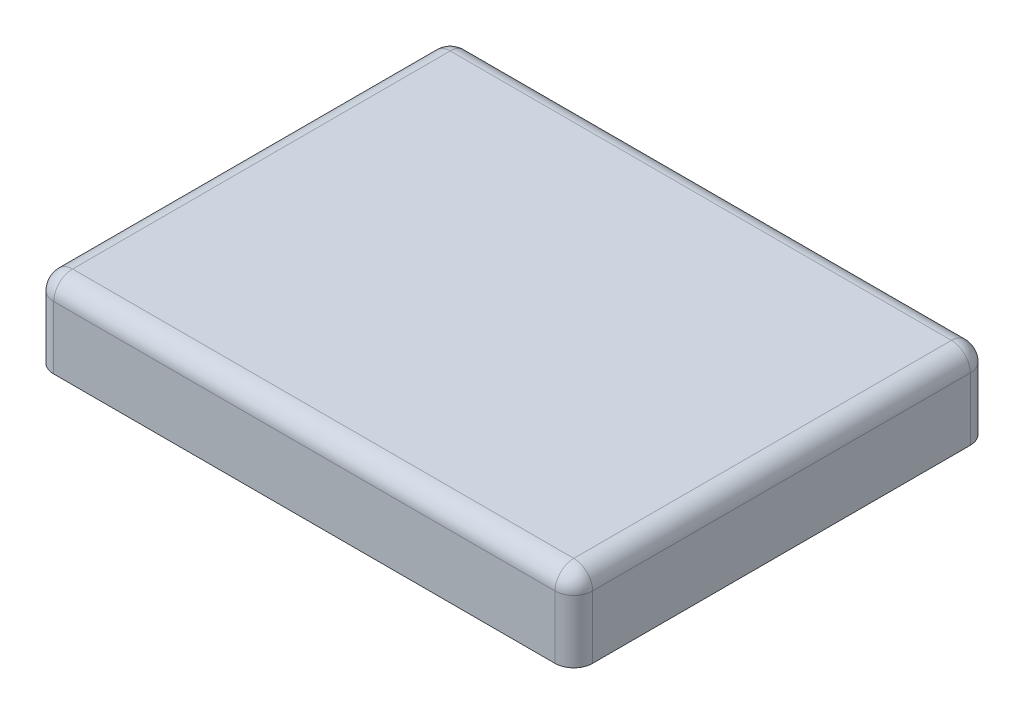
ISO-10303-21;
HEADER;
FILE_DESCRIPTION(('STEP AP214'),'2;1');
FILE_NAME('part.step','',(''),(''),'','','');
FILE_SCHEMA(('AUTOMOTIVE_DESIGN { 1 0 10303 214 1 1 1 1 }'));
ENDSEC;
DATA;
#1=APPLICATION_CONTEXT('core data for automotive mechanical design processes');
#2=APPLICATION_PROTOCOL_DEFINITION('international standard','automotive_design',2000,#1);
#3=PRODUCT_CONTEXT('',#1,'mechanical');
#4=PRODUCT('Part','Part','',(#3));
#5=PRODUCT_RELATED_PRODUCT_CATEGORY('part','',(#4));
#6=PRODUCT_DEFINITION_FORMATION('','',#4);
#7=PRODUCT_DEFINITION_CONTEXT('part definition',#1,'design');
#8=PRODUCT_DEFINITION('design','',#6,#7);
#9=PRODUCT_DEFINITION_SHAPE('','',#8);
#10=(LENGTH_UNIT() NAMED_UNIT(*) SI_UNIT(.MILLI.,.METRE.));
#11=(NAMED_UNIT(*) PLANE_ANGLE_UNIT() SI_UNIT($,.RADIAN.));
#12=(NAMED_UNIT(*) SI_UNIT($,.STERADIAN.) SOLID_ANGLE_UNIT());
#13=UNCERTAINTY_MEASURE_WITH_UNIT(LENGTH_MEASURE(1.E-05),#10,'distance_accuracy_value','');
#14=(GEOMETRIC_REPRESENTATION_CONTEXT(3) GLOBAL_UNCERTAINTY_ASSIGNED_CONTEXT((#13)) GLOBAL_UNIT_ASSIGNED_CONTEXT((#10,
#11,#12)) REPRESENTATION_CONTEXT('',''));
#15=CARTESIAN_POINT('',(0.,0.,0.));
#16=DIRECTION('',(0.,0.,1.));
#17=DIRECTION('',(1.,0.,0.));
#18=AXIS2_PLACEMENT_3D('',#15,#16,#17);
#19=CARTESIAN_POINT('',(0.,66.04,0.));
#20=DIRECTION('',(1.,0.,0.));
#21=DIRECTION('',(0.,0.,-1.));
#22=AXIS2_PLACEMENT_3D('',#19,#20,#21);
#23=PLANE('',#22);
#24=DIRECTION('',(0.,0.,1.));
#25=VECTOR('',#24,1.);
#26=CARTESIAN_POINT('',(0.,50.8,0.));
#27=LINE('',#26,#25);
#28=CARTESIAN_POINT('',(0.,50.8,-15.24));
#29=VERTEX_POINT('',#28);
#30=CARTESIAN_POINT('',(0.,50.8,-321.056));
#31=VERTEX_POINT('',#30);
#32=EDGE_CURVE('E128',#29,#31,#27,.F.);
#33=ORIENTED_EDGE('',*,*,#32,.T.);
#34=DIRECTION('',(0.,-1.,0.));
#35=VECTOR('',#34,1.);
#36=CARTESIAN_POINT('',(0.,66.04,-321.056));
#37=LINE('',#36,#35);
#38=CARTESIAN_POINT('',(0.,0.,-321.056));
#39=VERTEX_POINT('',#38);
#40=EDGE_CURVE('E114',#31,#39,#37,.T.);
#41=ORIENTED_EDGE('',*,*,#40,.T.);
#42=DIRECTION('',(0.,0.,1.));
#43=VECTOR('',#42,1.);
#44=CARTESIAN_POINT('',(0.,0.,0.));
#45=LINE('',#44,#43);
#46=CARTESIAN_POINT('',(0.,0.,-15.24));
#47=VERTEX_POINT('',#46);
#48=EDGE_CURVE('E125',#39,#47,#45,.T.);
#49=ORIENTED_EDGE('',*,*,#48,.T.);
#50=DIRECTION('',(0.,-1.,0.));
#51=VECTOR('',#50,1.);
#52=CARTESIAN_POINT('',(0.,66.04,-15.24));
#53=LINE('',#52,#51);
#54=EDGE_CURVE('E131',#47,#29,#53,.F.);
#55=ORIENTED_EDGE('',*,*,#54,.T.);
#56=EDGE_LOOP('',(#33,#41,#49,#55));
#57=FACE_BOUND('',#56,.T.);
#58=ADVANCED_FACE('F33',(#57),#23,.F.);
#59=CARTESIAN_POINT('',(0.,66.04,0.));
#60=DIRECTION('',(0.,0.,-1.));
#61=DIRECTION('',(-1.,0.,0.));
#62=AXIS2_PLACEMENT_3D('',#59,#60,#61);
#63=PLANE('',#62);
#64=DIRECTION('',(1.,0.,0.));
#65=VECTOR('',#64,1.);
#66=CARTESIAN_POINT('',(0.,0.,0.));
#67=LINE('',#66,#65);
#68=CARTESIAN_POINT('',(15.24,0.,0.));
#69=VERTEX_POINT('',#68);
#70=CARTESIAN_POINT('',(421.132,0.,0.));
#71=VERTEX_POINT('',#70);
#72=EDGE_CURVE('E136',#69,#71,#67,.T.);
#73=ORIENTED_EDGE('',*,*,#72,.T.);
#74=DIRECTION('',(0.,-1.,0.));
#75=VECTOR('',#74,1.);
#76=CARTESIAN_POINT('',(421.132,66.04,0.));
#77=LINE('',#76,#75);
#78=CARTESIAN_POINT('',(421.132,50.8,0.));
#79=VERTEX_POINT('',#78);
#80=EDGE_CURVE('E11',#71,#79,#77,.F.);
#81=ORIENTED_EDGE('',*,*,#80,.T.);
#82=DIRECTION('',(1.,0.,0.));
#83=VECTOR('',#82,1.);
#84=CARTESIAN_POINT('',(0.,50.8,0.));
#85=LINE('',#84,#83);
#86=CARTESIAN_POINT('',(15.24,50.8,0.));
#87=VERTEX_POINT('',#86);
#88=EDGE_CURVE('E49',#79,#87,#85,.F.);
#89=ORIENTED_EDGE('',*,*,#88,.T.);
#90=DIRECTION('',(0.,-1.,0.));
#91=VECTOR('',#90,1.);
#92=CARTESIAN_POINT('',(15.24,66.04,0.));
#93=LINE('',#92,#91);
#94=EDGE_CURVE('E42',#87,#69,#93,.T.);
#95=ORIENTED_EDGE('',*,*,#94,.T.);
#96=EDGE_LOOP('',(#73,#81,#89,#95));
#97=FACE_BOUND('',#96,.T.);
#98=ADVANCED_FACE('F244',(#97),#63,.F.);
#99=CARTESIAN_POINT('',(436.372,66.04,0.));
#100=DIRECTION('',(-1.,0.,0.));
#101=DIRECTION('',(0.,0.,1.));
#102=AXIS2_PLACEMENT_3D('',#99,#100,#101);
#103=PLANE('',#102);
#104=DIRECTION('',(0.,0.,-1.));
#105=VECTOR('',#104,1.);
#106=CARTESIAN_POINT('',(436.372,0.,0.));
#107=LINE('',#106,#105);
#108=CARTESIAN_POINT('',(436.372,0.,-15.24));
#109=VERTEX_POINT('',#108);
#110=CARTESIAN_POINT('',(436.372,0.,-321.056));
#111=VERTEX_POINT('',#110);
#112=EDGE_CURVE('E138',#109,#111,#107,.T.);
#113=ORIENTED_EDGE('',*,*,#112,.T.);
#114=DIRECTION('',(0.,-1.,0.));
#115=VECTOR('',#114,1.);
#116=CARTESIAN_POINT('',(436.372,66.04,-321.056));
#117=LINE('',#116,#115);
#118=CARTESIAN_POINT('',(436.372,50.8,-321.056));
#119=VERTEX_POINT('',#118);
#120=EDGE_CURVE('E170',#111,#119,#117,.F.);
#121=ORIENTED_EDGE('',*,*,#120,.T.);
#122=DIRECTION('',(0.,0.,-1.));
#123=VECTOR('',#122,1.);
#124=CARTESIAN_POINT('',(436.372,50.8,0.));
#125=LINE('',#124,#123);
#126=CARTESIAN_POINT('',(436.372,50.8,-15.24));
#127=VERTEX_POINT('',#126);
#128=EDGE_CURVE('E168',#119,#127,#125,.F.);
#129=ORIENTED_EDGE('',*,*,#128,.T.);
#130=DIRECTION('',(0.,-1.,0.));
#131=VECTOR('',#130,1.);
#132=CARTESIAN_POINT('',(436.372,66.04,-15.24));
#133=LINE('',#132,#131);
#134=EDGE_CURVE('E166',#127,#109,#133,.T.);
#135=ORIENTED_EDGE('',*,*,#134,.T.);
#136=EDGE_LOOP('',(#113,#121,#129,#135));
#137=FACE_BOUND('',#136,.T.);
#138=ADVANCED_FACE('F217',(#137),#103,.F.);
#139=CARTESIAN_POINT('',(0.,66.04,-336.296));
#140=DIRECTION('',(0.,0.,1.));
#141=DIRECTION('',(1.,0.,0.));
#142=AXIS2_PLACEMENT_3D('',#139,#140,#141);
#143=PLANE('',#142);
#144=DIRECTION('',(-1.,0.,0.));
#145=VECTOR('',#144,1.);
#146=CARTESIAN_POINT('',(0.,0.,-336.296));
#147=LINE('',#146,#145);
#148=CARTESIAN_POINT('',(421.132,0.,-336.296));
#149=VERTEX_POINT('',#148);
#150=CARTESIAN_POINT('',(15.24,0.,-336.296));
#151=VERTEX_POINT('',#150);
#152=EDGE_CURVE('E145',#149,#151,#147,.T.);
#153=ORIENTED_EDGE('',*,*,#152,.T.);
#154=DIRECTION('',(0.,-1.,0.));
#155=VECTOR('',#154,1.);
#156=CARTESIAN_POINT('',(15.24,66.04,-336.296));
#157=LINE('',#156,#155);
#158=CARTESIAN_POINT('',(15.24,50.8,-336.296));
#159=VERTEX_POINT('',#158);
#160=EDGE_CURVE('E115',#151,#159,#157,.F.);
#161=ORIENTED_EDGE('',*,*,#160,.T.);
#162=DIRECTION('',(-1.,0.,0.));
#163=VECTOR('',#162,1.);
#164=CARTESIAN_POINT('',(0.,50.8,-336.296));
#165=LINE('',#164,#163);
#166=CARTESIAN_POINT('',(421.132,50.8,-336.296));
#167=VERTEX_POINT('',#166);
#168=EDGE_CURVE('E154',#159,#167,#165,.F.);
#169=ORIENTED_EDGE('',*,*,#168,.T.);
#170=DIRECTION('',(0.,-1.,0.));
#171=VECTOR('',#170,1.);
#172=CARTESIAN_POINT('',(421.132,66.04,-336.296));
#173=LINE('',#172,#171);
#174=EDGE_CURVE('E120',#167,#149,#173,.T.);
#175=ORIENTED_EDGE('',*,*,#174,.T.);
#176=EDGE_LOOP('',(#153,#161,#169,#175));
#177=FACE_BOUND('',#176,.T.);
#178=ADVANCED_FACE('F251',(#177),#143,.F.);
#179=CARTESIAN_POINT('',(0.,66.04,0.));
#180=DIRECTION('',(0.,-1.,0.));
#181=DIRECTION('',(0.,0.,-1.));
#182=AXIS2_PLACEMENT_3D('',#179,#180,#181);
#183=PLANE('',#182);
#184=DIRECTION('',(0.,0.,-1.));
#185=VECTOR('',#184,1.);
#186=CARTESIAN_POINT('',(421.132,66.04,0.));
#187=LINE('',#186,#185);
#188=CARTESIAN_POINT('',(421.132,66.04,-15.24));
#189=VERTEX_POINT('',#188);
#190=CARTESIAN_POINT('',(421.132,66.04,-321.056));
#191=VERTEX_POINT('',#190);
#192=EDGE_CURVE('E161',#189,#191,#187,.T.);
#193=ORIENTED_EDGE('',*,*,#192,.T.);
#194=DIRECTION('',(-1.,0.,0.));
#195=VECTOR('',#194,1.);
#196=CARTESIAN_POINT('',(0.,66.04,-321.056));
#197=LINE('',#196,#195);
#198=CARTESIAN_POINT('',(15.24,66.04,-321.056));
#199=VERTEX_POINT('',#198);
#200=EDGE_CURVE('E163',#191,#199,#197,.T.);
#201=ORIENTED_EDGE('',*,*,#200,.T.);
#202=DIRECTION('',(0.,0.,1.));
#203=VECTOR('',#202,1.);
#204=CARTESIAN_POINT('',(15.24,66.04,0.));
#205=LINE('',#204,#203);
#206=CARTESIAN_POINT('',(15.24,66.04,-15.24));
#207=VERTEX_POINT('',#206);
#208=EDGE_CURVE('E159',#199,#207,#205,.T.);
#209=ORIENTED_EDGE('',*,*,#208,.T.);
#210=DIRECTION('',(1.,0.,0.));
#211=VECTOR('',#210,1.);
#212=CARTESIAN_POINT('',(0.,66.04,-15.24));
#213=LINE('',#212,#211);
#214=EDGE_CURVE('E157',#207,#189,#213,.T.);
#215=ORIENTED_EDGE('',*,*,#214,.T.);
#216=EDGE_LOOP('',(#193,#201,#209,#215));
#217=FACE_BOUND('',#216,.T.);
#218=ADVANCED_FACE('F233',(#217),#183,.F.);
#219=CARTESIAN_POINT('',(0.,0.,0.));
#220=DIRECTION('',(0.,-1.,0.));
#221=DIRECTION('',(0.,0.,-1.));
#222=AXIS2_PLACEMENT_3D('',#219,#220,#221);
#223=PLANE('',#222);
#224=ORIENTED_EDGE('',*,*,#48,.F.);
#225=CARTESIAN_POINT('',(15.24,0.,-321.056));
#226=DIRECTION('',(0.,-1.,0.));
#227=DIRECTION('',(0.,0.,-1.));
#228=AXIS2_PLACEMENT_3D('',#225,#226,#227);
#229=CIRCLE('',#228,15.24);
#230=EDGE_CURVE('E110',#39,#151,#229,.T.);
#231=ORIENTED_EDGE('',*,*,#230,.T.);
#232=ORIENTED_EDGE('',*,*,#152,.F.);
#233=CARTESIAN_POINT('',(421.132,0.,-321.056));
#234=DIRECTION('',(0.,-1.,0.));
#235=DIRECTION('',(0.,0.,-1.));
#236=AXIS2_PLACEMENT_3D('',#233,#234,#235);
#237=CIRCLE('',#236,15.24);
#238=EDGE_CURVE('E121',#149,#111,#237,.T.);
#239=ORIENTED_EDGE('',*,*,#238,.T.);
#240=ORIENTED_EDGE('',*,*,#112,.F.);
#241=CARTESIAN_POINT('',(421.132,0.,-15.24));
#242=DIRECTION('',(0.,-1.,0.));
#243=DIRECTION('',(0.,0.,-1.));
#244=AXIS2_PLACEMENT_3D('',#241,#242,#243);
#245=CIRCLE('',#244,15.24);
#246=EDGE_CURVE('E150',#109,#71,#245,.T.);
#247=ORIENTED_EDGE('',*,*,#246,.T.);
#248=ORIENTED_EDGE('',*,*,#72,.F.);
#249=CARTESIAN_POINT('',(15.24,0.,-15.24));
#250=DIRECTION('',(0.,-1.,0.));
#251=DIRECTION('',(0.,0.,-1.));
#252=AXIS2_PLACEMENT_3D('',#249,#250,#251);
#253=CIRCLE('',#252,15.24);
#254=EDGE_CURVE('E130',#69,#47,#253,.T.);
#255=ORIENTED_EDGE('',*,*,#254,.T.);
#256=EDGE_LOOP('',(#224,#231,#232,#239,#240,#247,#248,#255));
#257=FACE_BOUND('',#256,.T.);
#258=ADVANCED_FACE('F133',(#257),#223,.T.);
#259=CARTESIAN_POINT('',(421.132,66.04,-15.24));
#260=DIRECTION('',(0.,-1.,0.));
#261=DIRECTION('',(0.,0.,-1.));
#262=AXIS2_PLACEMENT_3D('',#259,#260,#261);
#263=CYLINDRICAL_SURFACE('',#262,15.24);
#264=CARTESIAN_POINT('',(421.132,50.8,-15.24));
#265=DIRECTION('',(0.,1.,0.));
#266=DIRECTION('',(0.,0.,1.));
#267=AXIS2_PLACEMENT_3D('',#264,#265,#266);
#268=CIRCLE('',#267,15.24);
#269=EDGE_CURVE('E37',#79,#127,#268,.T.);
#270=ORIENTED_EDGE('',*,*,#269,.F.);
#271=ORIENTED_EDGE('',*,*,#80,.F.);
#272=ORIENTED_EDGE('',*,*,#246,.F.);
#273=ORIENTED_EDGE('',*,*,#134,.F.);
#274=EDGE_LOOP('',(#270,#271,#272,#273));
#275=FACE_BOUND('',#274,.T.);
#276=ADVANCED_FACE('F35',(#275),#263,.T.);
#277=CARTESIAN_POINT('',(421.132,50.8,-15.24));
#278=DIRECTION('',(0.,0.,1.));
#279=DIRECTION('',(1.,0.,0.));
#280=AXIS2_PLACEMENT_3D('',#277,#278,#279);
#281=SPHERICAL_SURFACE('',#280,15.24);
#282=CARTESIAN_POINT('',(421.132,50.8,-15.24));
#283=DIRECTION('',(1.,0.,0.));
#284=DIRECTION('',(0.,0.,-1.));
#285=AXIS2_PLACEMENT_3D('',#282,#283,#284);
#286=CIRCLE('',#285,15.24);
#287=EDGE_CURVE('E199',#79,#189,#286,.F.);
#288=ORIENTED_EDGE('',*,*,#287,.F.);
#289=ORIENTED_EDGE('',*,*,#269,.T.);
#290=CARTESIAN_POINT('',(421.132,50.8,-15.24));
#291=DIRECTION('',(0.,0.,1.));
#292=DIRECTION('',(1.,0.,0.));
#293=AXIS2_PLACEMENT_3D('',#290,#291,#292);
#294=CIRCLE('',#293,15.24);
#295=EDGE_CURVE('E141',#189,#127,#294,.F.);
#296=ORIENTED_EDGE('',*,*,#295,.F.);
#297=EDGE_LOOP('',(#288,#289,#296));
#298=FACE_BOUND('',#297,.T.);
#299=ADVANCED_FACE('F211',(#298),#281,.T.);
#300=CARTESIAN_POINT('',(421.132,66.04,-321.056));
#301=DIRECTION('',(0.,-1.,0.));
#302=DIRECTION('',(0.,0.,-1.));
#303=AXIS2_PLACEMENT_3D('',#300,#301,#302);
#304=CYLINDRICAL_SURFACE('',#303,15.24);
#305=ORIENTED_EDGE('',*,*,#238,.F.);
#306=ORIENTED_EDGE('',*,*,#174,.F.);
#307=CARTESIAN_POINT('',(421.132,50.8,-321.056));
#308=DIRECTION('',(0.,1.,0.));
#309=DIRECTION('',(0.,0.,1.));
#310=AXIS2_PLACEMENT_3D('',#307,#308,#309);
#311=CIRCLE('',#310,15.24);
#312=EDGE_CURVE('E196',#119,#167,#311,.T.);
#313=ORIENTED_EDGE('',*,*,#312,.F.);
#314=ORIENTED_EDGE('',*,*,#120,.F.);
#315=EDGE_LOOP('',(#305,#306,#313,#314));
#316=FACE_BOUND('',#315,.T.);
#317=ADVANCED_FACE('F222',(#316),#304,.T.);
#318=CARTESIAN_POINT('',(421.132,50.8,0.));
#319=DIRECTION('',(0.,0.,-1.));
#320=DIRECTION('',(-1.,0.,0.));
#321=AXIS2_PLACEMENT_3D('',#318,#319,#320);
#322=CYLINDRICAL_SURFACE('',#321,15.24);
#323=ORIENTED_EDGE('',*,*,#295,.T.);
#324=ORIENTED_EDGE('',*,*,#128,.F.);
#325=CARTESIAN_POINT('',(421.132,50.8,-321.056));
#326=DIRECTION('',(0.,0.,-1.));
#327=DIRECTION('',(-1.,0.,0.));
#328=AXIS2_PLACEMENT_3D('',#325,#326,#327);
#329=CIRCLE('',#328,15.24);
#330=EDGE_CURVE('E193',#191,#119,#329,.T.);
#331=ORIENTED_EDGE('',*,*,#330,.F.);
#332=ORIENTED_EDGE('',*,*,#192,.F.);
#333=EDGE_LOOP('',(#323,#324,#331,#332));
#334=FACE_BOUND('',#333,.T.);
#335=ADVANCED_FACE('F206',(#334),#322,.T.);
#336=CARTESIAN_POINT('',(0.,50.8,-15.24));
#337=DIRECTION('',(1.,0.,0.));
#338=DIRECTION('',(0.,0.,-1.));
#339=AXIS2_PLACEMENT_3D('',#336,#337,#338);
#340=CYLINDRICAL_SURFACE('',#339,15.24);
#341=ORIENTED_EDGE('',*,*,#287,.T.);
#342=ORIENTED_EDGE('',*,*,#214,.F.);
#343=CARTESIAN_POINT('',(15.24,50.8,-15.24));
#344=DIRECTION('',(-1.,0.,0.));
#345=DIRECTION('',(0.,0.,1.));
#346=AXIS2_PLACEMENT_3D('',#343,#344,#345);
#347=CIRCLE('',#346,15.24);
#348=EDGE_CURVE('E190',#87,#207,#347,.T.);
#349=ORIENTED_EDGE('',*,*,#348,.F.);
#350=ORIENTED_EDGE('',*,*,#88,.F.);
#351=EDGE_LOOP('',(#341,#342,#349,#350));
#352=FACE_BOUND('',#351,.T.);
#353=ADVANCED_FACE('F237',(#352),#340,.T.);
#354=CARTESIAN_POINT('',(15.24,66.04,-15.24));
#355=DIRECTION('',(0.,-1.,0.));
#356=DIRECTION('',(0.,0.,-1.));
#357=AXIS2_PLACEMENT_3D('',#354,#355,#356);
#358=CYLINDRICAL_SURFACE('',#357,15.24);
#359=ORIENTED_EDGE('',*,*,#254,.F.);
#360=ORIENTED_EDGE('',*,*,#94,.F.);
#361=CARTESIAN_POINT('',(15.24,50.8,-15.24));
#362=DIRECTION('',(0.,1.,0.));
#363=DIRECTION('',(0.,0.,1.));
#364=AXIS2_PLACEMENT_3D('',#361,#362,#363);
#365=CIRCLE('',#364,15.24);
#366=EDGE_CURVE('E187',#29,#87,#365,.T.);
#367=ORIENTED_EDGE('',*,*,#366,.F.);
#368=ORIENTED_EDGE('',*,*,#54,.F.);
#369=EDGE_LOOP('',(#359,#360,#367,#368));
#370=FACE_BOUND('',#369,.T.);
#371=ADVANCED_FACE('F243',(#370),#358,.T.);
#372=CARTESIAN_POINT('',(421.132,50.8,-321.056));
#373=DIRECTION('',(0.,0.,1.));
#374=DIRECTION('',(1.,0.,0.));
#375=AXIS2_PLACEMENT_3D('',#372,#373,#374);
#376=SPHERICAL_SURFACE('',#375,15.24);
#377=ORIENTED_EDGE('',*,*,#330,.T.);
#378=ORIENTED_EDGE('',*,*,#312,.T.);
#379=CARTESIAN_POINT('',(421.132,50.8,-321.056));
#380=DIRECTION('',(1.,0.,0.));
#381=DIRECTION('',(0.,0.,-1.));
#382=AXIS2_PLACEMENT_3D('',#379,#380,#381);
#383=CIRCLE('',#382,15.24);
#384=EDGE_CURVE('E184',#191,#167,#383,.F.);
#385=ORIENTED_EDGE('',*,*,#384,.F.);
#386=EDGE_LOOP('',(#377,#378,#385));
#387=FACE_BOUND('',#386,.T.);
#388=ADVANCED_FACE('F225',(#387),#376,.T.);
#389=CARTESIAN_POINT('',(15.24,50.8,-15.24));
#390=DIRECTION('',(0.,0.,1.));
#391=DIRECTION('',(1.,0.,0.));
#392=AXIS2_PLACEMENT_3D('',#389,#390,#391);
#393=SPHERICAL_SURFACE('',#392,15.24);
#394=ORIENTED_EDGE('',*,*,#366,.T.);
#395=ORIENTED_EDGE('',*,*,#348,.T.);
#396=CARTESIAN_POINT('',(15.24,50.8,-15.24));
#397=DIRECTION('',(0.,0.,1.));
#398=DIRECTION('',(1.,0.,0.));
#399=AXIS2_PLACEMENT_3D('',#396,#397,#398);
#400=CIRCLE('',#399,15.24);
#401=EDGE_CURVE('E181',#29,#207,#400,.F.);
#402=ORIENTED_EDGE('',*,*,#401,.F.);
#403=EDGE_LOOP('',(#394,#395,#402));
#404=FACE_BOUND('',#403,.T.);
#405=ADVANCED_FACE('F241',(#404),#393,.T.);
#406=CARTESIAN_POINT('',(0.,50.8,-321.056));
#407=DIRECTION('',(-1.,0.,0.));
#408=DIRECTION('',(0.,0.,1.));
#409=AXIS2_PLACEMENT_3D('',#406,#407,#408);
#410=CYLINDRICAL_SURFACE('',#409,15.24);
#411=ORIENTED_EDGE('',*,*,#384,.T.);
#412=ORIENTED_EDGE('',*,*,#168,.F.);
#413=CARTESIAN_POINT('',(15.24,50.8,-321.056));
#414=DIRECTION('',(-1.,0.,0.));
#415=DIRECTION('',(0.,0.,1.));
#416=AXIS2_PLACEMENT_3D('',#413,#414,#415);
#417=CIRCLE('',#416,15.24);
#418=EDGE_CURVE('E178',#199,#159,#417,.T.);
#419=ORIENTED_EDGE('',*,*,#418,.F.);
#420=ORIENTED_EDGE('',*,*,#200,.F.);
#421=EDGE_LOOP('',(#411,#412,#419,#420));
#422=FACE_BOUND('',#421,.T.);
#423=ADVANCED_FACE('F230',(#422),#410,.T.);
#424=CARTESIAN_POINT('',(15.24,50.8,0.));
#425=DIRECTION('',(0.,0.,1.));
#426=DIRECTION('',(1.,0.,0.));
#427=AXIS2_PLACEMENT_3D('',#424,#425,#426);
#428=CYLINDRICAL_SURFACE('',#427,15.24);
#429=ORIENTED_EDGE('',*,*,#401,.T.);
#430=ORIENTED_EDGE('',*,*,#208,.F.);
#431=CARTESIAN_POINT('',(15.24,50.8,-321.056));
#432=DIRECTION('',(0.,0.,-1.));
#433=DIRECTION('',(-1.,0.,0.));
#434=AXIS2_PLACEMENT_3D('',#431,#432,#433);
#435=CIRCLE('',#434,15.24);
#436=EDGE_CURVE('E176',#31,#199,#435,.T.);
#437=ORIENTED_EDGE('',*,*,#436,.F.);
#438=ORIENTED_EDGE('',*,*,#32,.F.);
#439=EDGE_LOOP('',(#429,#430,#437,#438));
#440=FACE_BOUND('',#439,.T.);
#441=ADVANCED_FACE('F261',(#440),#428,.T.);
#442=CARTESIAN_POINT('',(15.24,50.8,-321.056));
#443=DIRECTION('',(0.,0.,1.));
#444=DIRECTION('',(1.,0.,0.));
#445=AXIS2_PLACEMENT_3D('',#442,#443,#444);
#446=SPHERICAL_SURFACE('',#445,15.24);
#447=ORIENTED_EDGE('',*,*,#436,.T.);
#448=ORIENTED_EDGE('',*,*,#418,.T.);
#449=CARTESIAN_POINT('',(15.24,50.8,-321.056));
#450=DIRECTION('',(0.,1.,0.));
#451=DIRECTION('',(0.,0.,1.));
#452=AXIS2_PLACEMENT_3D('',#449,#450,#451);
#453=CIRCLE('',#452,15.24);
#454=EDGE_CURVE('E174',#31,#159,#453,.F.);
#455=ORIENTED_EDGE('',*,*,#454,.F.);
#456=EDGE_LOOP('',(#447,#448,#455));
#457=FACE_BOUND('',#456,.T.);
#458=ADVANCED_FACE('F258',(#457),#446,.T.);
#459=CARTESIAN_POINT('',(15.24,66.04,-321.056));
#460=DIRECTION('',(0.,-1.,0.));
#461=DIRECTION('',(0.,0.,-1.));
#462=AXIS2_PLACEMENT_3D('',#459,#460,#461);
#463=CYLINDRICAL_SURFACE('',#462,15.24);
#464=ORIENTED_EDGE('',*,*,#454,.T.);
#465=ORIENTED_EDGE('',*,*,#160,.F.);
#466=ORIENTED_EDGE('',*,*,#230,.F.);
#467=ORIENTED_EDGE('',*,*,#40,.F.);
#468=EDGE_LOOP('',(#464,#465,#466,#467));
#469=FACE_BOUND('',#468,.T.);
#470=ADVANCED_FACE('F113',(#469),#463,.T.);
#471=CLOSED_SHELL('',(#58,#98,#138,#178,#218,#258,#276,#299,#317,#335,#353,#371,#388,#405,#423,
#441,#458,#470));
#472=MANIFOLD_SOLID_BREP('B2',#471);
#473=ADVANCED_BREP_SHAPE_REPRESENTATION('',(#18,#472),#14);
#474=SHAPE_DEFINITION_REPRESENTATION(#9,#473);
ENDSEC;
END-ISO-10303-21;
